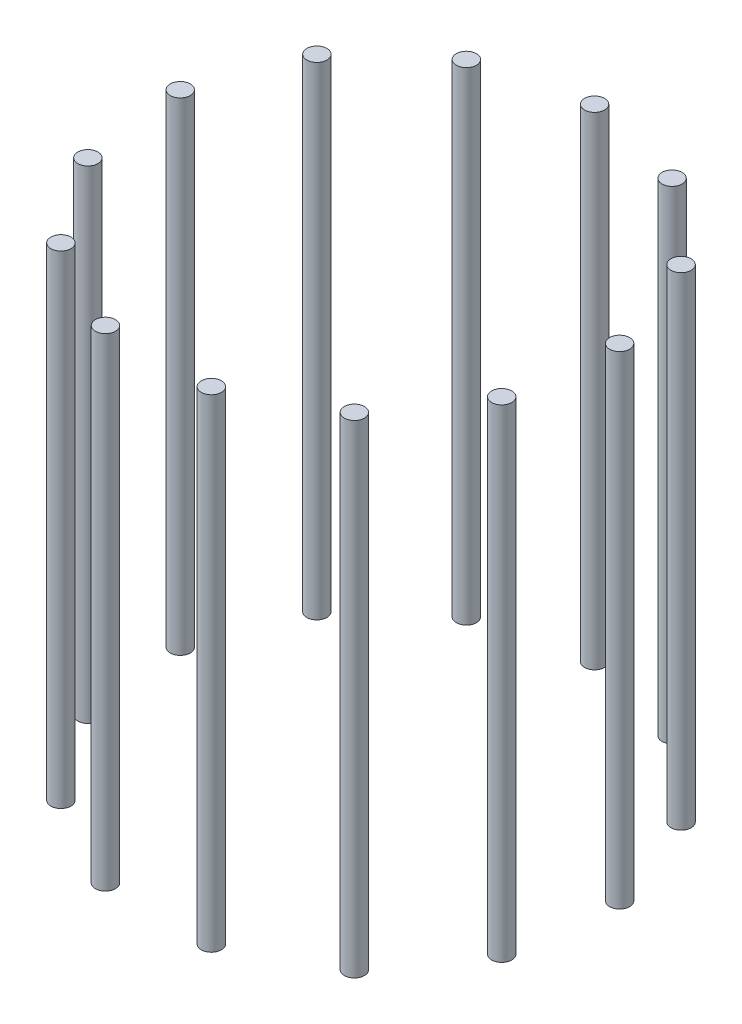
ISO-10303-21;
HEADER;
FILE_DESCRIPTION(('STEP AP214'),'2;1');
FILE_NAME('part.step','',(''),(''),'','','');
FILE_SCHEMA(('AUTOMOTIVE_DESIGN { 1 0 10303 214 1 1 1 1 }'));
ENDSEC;
DATA;
#1=APPLICATION_CONTEXT('core data for automotive mechanical design processes');
#2=APPLICATION_PROTOCOL_DEFINITION('international standard','automotive_design',2000,#1);
#3=PRODUCT_CONTEXT('',#1,'mechanical');
#4=PRODUCT('Part','Part','',(#3));
#5=PRODUCT_RELATED_PRODUCT_CATEGORY('part','',(#4));
#6=PRODUCT_DEFINITION_FORMATION('','',#4);
#7=PRODUCT_DEFINITION_CONTEXT('part definition',#1,'design');
#8=PRODUCT_DEFINITION('design','',#6,#7);
#9=PRODUCT_DEFINITION_SHAPE('','',#8);
#10=(LENGTH_UNIT() NAMED_UNIT(*) SI_UNIT(.MILLI.,.METRE.));
#11=(NAMED_UNIT(*) PLANE_ANGLE_UNIT() SI_UNIT($,.RADIAN.));
#12=(NAMED_UNIT(*) SI_UNIT($,.STERADIAN.) SOLID_ANGLE_UNIT());
#13=UNCERTAINTY_MEASURE_WITH_UNIT(LENGTH_MEASURE(1.E-05),#10,'distance_accuracy_value','');
#14=(GEOMETRIC_REPRESENTATION_CONTEXT(3) GLOBAL_UNCERTAINTY_ASSIGNED_CONTEXT((#13)) GLOBAL_UNIT_ASSIGNED_CONTEXT((#10,
#11,#12)) REPRESENTATION_CONTEXT('',''));
#15=CARTESIAN_POINT('',(0.,0.,0.));
#16=DIRECTION('',(0.,0.,1.));
#17=DIRECTION('',(1.,0.,0.));
#18=AXIS2_PLACEMENT_3D('',#15,#16,#17);
#19=CARTESIAN_POINT('',(-2.5559774462407,-12.,-4.87000814109254));
#20=DIRECTION('',(0.,1.,0.));
#21=DIRECTION('',(0.,0.,1.));
#22=AXIS2_PLACEMENT_3D('',#19,#20,#21);
#23=CYLINDRICAL_SURFACE('',#22,0.250000000000128);
#24=CARTESIAN_POINT('',(-2.5559774462407,-12.,-4.87000814109254));
#25=DIRECTION('',(0.,1.,0.));
#26=DIRECTION('',(0.,0.,1.));
#27=AXIS2_PLACEMENT_3D('',#24,#25,#26);
#28=CIRCLE('',#27,0.250000000000128);
#29=CARTESIAN_POINT('',(-2.5559774462407,-12.,-4.62000814109242));
#30=VERTEX_POINT('',#29);
#31=EDGE_CURVE('E11',#30,#30,#28,.T.);
#32=ORIENTED_EDGE('',*,*,#31,.T.);
#33=EDGE_LOOP('',(#32));
#34=FACE_BOUND('',#33,.T.);
#35=CARTESIAN_POINT('',(-2.5559774462407,0.,-4.87000814109254));
#36=DIRECTION('',(0.,1.,0.));
#37=DIRECTION('',(0.,0.,1.));
#38=AXIS2_PLACEMENT_3D('',#35,#36,#37);
#39=CIRCLE('',#38,0.250000000000128);
#40=CARTESIAN_POINT('',(-2.5559774462407,0.,-4.62000814109242));
#41=VERTEX_POINT('',#40);
#42=EDGE_CURVE('E45',#41,#41,#39,.T.);
#43=ORIENTED_EDGE('',*,*,#42,.F.);
#44=EDGE_LOOP('',(#43));
#45=FACE_BOUND('',#44,.T.);
#46=ADVANCED_FACE('F42',(#34,#45),#23,.T.);
#47=CARTESIAN_POINT('',(-2.5559774462407,-12.,-4.87000814109254));
#48=DIRECTION('',(0.,1.,0.));
#49=DIRECTION('',(0.,0.,1.));
#50=AXIS2_PLACEMENT_3D('',#47,#48,#49);
#51=PLANE('',#50);
#52=ORIENTED_EDGE('',*,*,#31,.F.);
#53=EDGE_LOOP('',(#52));
#54=FACE_BOUND('',#53,.T.);
#55=ADVANCED_FACE('F57',(#54),#51,.F.);
#56=CARTESIAN_POINT('',(-2.5559774462407,0.,-4.87000814109254));
#57=DIRECTION('',(0.,1.,0.));
#58=DIRECTION('',(0.,0.,1.));
#59=AXIS2_PLACEMENT_3D('',#56,#57,#58);
#60=PLANE('',#59);
#61=ORIENTED_EDGE('',*,*,#42,.T.);
#62=EDGE_LOOP('',(#61));
#63=FACE_BOUND('',#62,.T.);
#64=ADVANCED_FACE('F54',(#63),#60,.T.);
#65=CLOSED_SHELL('',(#46,#55,#64));
#66=MANIFOLD_SOLID_BREP('B2',#65);
#67=CARTESIAN_POINT('',(-4.52641126241501,-12.,-3.12435610702116));
#68=DIRECTION('',(0.,1.,0.));
#69=DIRECTION('',(0.,0.,1.));
#70=AXIS2_PLACEMENT_3D('',#67,#68,#69);
#71=CYLINDRICAL_SURFACE('',#70,0.250000000000218);
#72=CARTESIAN_POINT('',(-4.52641126241501,-12.,-3.12435610702116));
#73=DIRECTION('',(0.,1.,0.));
#74=DIRECTION('',(0.,0.,1.));
#75=AXIS2_PLACEMENT_3D('',#72,#73,#74);
#76=CIRCLE('',#75,0.250000000000218);
#77=CARTESIAN_POINT('',(-4.52641126241501,-12.,-2.87435610702095));
#78=VERTEX_POINT('',#77);
#79=EDGE_CURVE('E41',#78,#78,#76,.T.);
#80=ORIENTED_EDGE('',*,*,#79,.T.);
#81=EDGE_LOOP('',(#80));
#82=FACE_BOUND('',#81,.T.);
#83=CARTESIAN_POINT('',(-4.52641126241501,0.,-3.12435610702116));
#84=DIRECTION('',(0.,1.,0.));
#85=DIRECTION('',(0.,0.,1.));
#86=AXIS2_PLACEMENT_3D('',#83,#84,#85);
#87=CIRCLE('',#86,0.250000000000218);
#88=CARTESIAN_POINT('',(-4.52641126241501,0.,-2.87435610702095));
#89=VERTEX_POINT('',#88);
#90=EDGE_CURVE('E94',#89,#89,#87,.T.);
#91=ORIENTED_EDGE('',*,*,#90,.F.);
#92=EDGE_LOOP('',(#91));
#93=FACE_BOUND('',#92,.T.);
#94=ADVANCED_FACE('F91',(#82,#93),#71,.T.);
#95=CARTESIAN_POINT('',(-4.52641126241501,-12.,-3.12435610702116));
#96=DIRECTION('',(0.,1.,0.));
#97=DIRECTION('',(0.,0.,1.));
#98=AXIS2_PLACEMENT_3D('',#95,#96,#97);
#99=PLANE('',#98);
#100=ORIENTED_EDGE('',*,*,#79,.F.);
#101=EDGE_LOOP('',(#100));
#102=FACE_BOUND('',#101,.T.);
#103=ADVANCED_FACE('F106',(#102),#99,.F.);
#104=CARTESIAN_POINT('',(-4.52641126241501,0.,-3.12435610702116));
#105=DIRECTION('',(0.,1.,0.));
#106=DIRECTION('',(0.,0.,1.));
#107=AXIS2_PLACEMENT_3D('',#104,#105,#106);
#108=PLANE('',#107);
#109=ORIENTED_EDGE('',*,*,#90,.T.);
#110=EDGE_LOOP('',(#109));
#111=FACE_BOUND('',#110,.T.);
#112=ADVANCED_FACE('F103',(#111),#108,.T.);
#113=CLOSED_SHELL('',(#94,#103,#112));
#114=MANIFOLD_SOLID_BREP('B6',#113);
#115=CARTESIAN_POINT('',(-5.45989880753909,-12.,-0.662951741404041));
#116=DIRECTION('',(0.,1.,0.));
#117=DIRECTION('',(0.,0.,1.));
#118=AXIS2_PLACEMENT_3D('',#115,#116,#117);
#119=CYLINDRICAL_SURFACE('',#118,0.250000000000326);
#120=CARTESIAN_POINT('',(-5.45989880753909,-12.,-0.662951741404041));
#121=DIRECTION('',(0.,1.,0.));
#122=DIRECTION('',(0.,0.,1.));
#123=AXIS2_PLACEMENT_3D('',#120,#121,#122);
#124=CIRCLE('',#123,0.250000000000326);
#125=CARTESIAN_POINT('',(-5.45989880753909,-12.,-0.412951741403715));
#126=VERTEX_POINT('',#125);
#127=EDGE_CURVE('E90',#126,#126,#124,.T.);
#128=ORIENTED_EDGE('',*,*,#127,.T.);
#129=EDGE_LOOP('',(#128));
#130=FACE_BOUND('',#129,.T.);
#131=CARTESIAN_POINT('',(-5.45989880753909,0.,-0.662951741404041));
#132=DIRECTION('',(0.,1.,0.));
#133=DIRECTION('',(0.,0.,1.));
#134=AXIS2_PLACEMENT_3D('',#131,#132,#133);
#135=CIRCLE('',#134,0.250000000000326);
#136=CARTESIAN_POINT('',(-5.45989880753909,0.,-0.412951741403715));
#137=VERTEX_POINT('',#136);
#138=EDGE_CURVE('E143',#137,#137,#135,.T.);
#139=ORIENTED_EDGE('',*,*,#138,.F.);
#140=EDGE_LOOP('',(#139));
#141=FACE_BOUND('',#140,.T.);
#142=ADVANCED_FACE('F140',(#130,#141),#119,.T.);
#143=CARTESIAN_POINT('',(-5.45989880753909,-12.,-0.662951741404041));
#144=DIRECTION('',(0.,1.,0.));
#145=DIRECTION('',(0.,0.,1.));
#146=AXIS2_PLACEMENT_3D('',#143,#144,#145);
#147=PLANE('',#146);
#148=ORIENTED_EDGE('',*,*,#127,.F.);
#149=EDGE_LOOP('',(#148));
#150=FACE_BOUND('',#149,.T.);
#151=ADVANCED_FACE('F155',(#150),#147,.F.);
#152=CARTESIAN_POINT('',(-5.45989880753909,0.,-0.662951741404041));
#153=DIRECTION('',(0.,1.,0.));
#154=DIRECTION('',(0.,0.,1.));
#155=AXIS2_PLACEMENT_3D('',#152,#153,#154);
#156=PLANE('',#155);
#157=ORIENTED_EDGE('',*,*,#138,.T.);
#158=EDGE_LOOP('',(#157));
#159=FACE_BOUND('',#158,.T.);
#160=ADVANCED_FACE('F152',(#159),#156,.T.);
#161=CLOSED_SHELL('',(#142,#151,#160));
#162=MANIFOLD_SOLID_BREP('B36',#161);
#163=CARTESIAN_POINT('',(-5.14258933476946,-12.,1.95032687873417));
#164=DIRECTION('',(0.,1.,0.));
#165=DIRECTION('',(0.,0.,1.));
#166=AXIS2_PLACEMENT_3D('',#163,#164,#165);
#167=CYLINDRICAL_SURFACE('',#166,0.250000000000417);
#168=CARTESIAN_POINT('',(-5.14258933476946,-12.,1.95032687873417));
#169=DIRECTION('',(0.,1.,0.));
#170=DIRECTION('',(0.,0.,1.));
#171=AXIS2_PLACEMENT_3D('',#168,#169,#170);
#172=CIRCLE('',#171,0.250000000000417);
#173=CARTESIAN_POINT('',(-5.14258933476946,-12.,2.20032687873458));
#174=VERTEX_POINT('',#173);
#175=EDGE_CURVE('E139',#174,#174,#172,.T.);
#176=ORIENTED_EDGE('',*,*,#175,.T.);
#177=EDGE_LOOP('',(#176));
#178=FACE_BOUND('',#177,.T.);
#179=CARTESIAN_POINT('',(-5.14258933476946,0.,1.95032687873417));
#180=DIRECTION('',(0.,1.,0.));
#181=DIRECTION('',(0.,0.,1.));
#182=AXIS2_PLACEMENT_3D('',#179,#180,#181);
#183=CIRCLE('',#182,0.250000000000417);
#184=CARTESIAN_POINT('',(-5.14258933476946,0.,2.20032687873458));
#185=VERTEX_POINT('',#184);
#186=EDGE_CURVE('E192',#185,#185,#183,.T.);
#187=ORIENTED_EDGE('',*,*,#186,.F.);
#188=EDGE_LOOP('',(#187));
#189=FACE_BOUND('',#188,.T.);
#190=ADVANCED_FACE('F189',(#178,#189),#167,.T.);
#191=CARTESIAN_POINT('',(-5.14258933476946,-12.,1.95032687873417));
#192=DIRECTION('',(0.,1.,0.));
#193=DIRECTION('',(0.,0.,1.));
#194=AXIS2_PLACEMENT_3D('',#191,#192,#193);
#195=PLANE('',#194);
#196=ORIENTED_EDGE('',*,*,#175,.F.);
#197=EDGE_LOOP('',(#196));
#198=FACE_BOUND('',#197,.T.);
#199=ADVANCED_FACE('F204',(#198),#195,.F.);
#200=CARTESIAN_POINT('',(-5.14258933476946,0.,1.95032687873417));
#201=DIRECTION('',(0.,1.,0.));
#202=DIRECTION('',(0.,0.,1.));
#203=AXIS2_PLACEMENT_3D('',#200,#201,#202);
#204=PLANE('',#203);
#205=ORIENTED_EDGE('',*,*,#186,.T.);
#206=EDGE_LOOP('',(#205));
#207=FACE_BOUND('',#206,.T.);
#208=ADVANCED_FACE('F201',(#207),#204,.T.);
#209=CLOSED_SHELL('',(#190,#199,#208));
#210=MANIFOLD_SOLID_BREP('B85',#209);
#211=CARTESIAN_POINT('',(-3.64717462032396,-12.,4.11680911494121));
#212=DIRECTION('',(0.,1.,0.));
#213=DIRECTION('',(0.,0.,1.));
#214=AXIS2_PLACEMENT_3D('',#211,#212,#213);
#215=CYLINDRICAL_SURFACE('',#214,0.250000000000482);
#216=CARTESIAN_POINT('',(-3.64717462032396,-12.,4.11680911494121));
#217=DIRECTION('',(0.,1.,0.));
#218=DIRECTION('',(0.,0.,1.));
#219=AXIS2_PLACEMENT_3D('',#216,#217,#218);
#220=CIRCLE('',#219,0.250000000000482);
#221=CARTESIAN_POINT('',(-3.64717462032396,-12.,4.36680911494169));
#222=VERTEX_POINT('',#221);
#223=EDGE_CURVE('E188',#222,#222,#220,.T.);
#224=ORIENTED_EDGE('',*,*,#223,.T.);
#225=EDGE_LOOP('',(#224));
#226=FACE_BOUND('',#225,.T.);
#227=CARTESIAN_POINT('',(-3.64717462032396,0.,4.11680911494121));
#228=DIRECTION('',(0.,1.,0.));
#229=DIRECTION('',(0.,0.,1.));
#230=AXIS2_PLACEMENT_3D('',#227,#228,#229);
#231=CIRCLE('',#230,0.250000000000482);
#232=CARTESIAN_POINT('',(-3.64717462032396,0.,4.36680911494169));
#233=VERTEX_POINT('',#232);
#234=EDGE_CURVE('E241',#233,#233,#231,.T.);
#235=ORIENTED_EDGE('',*,*,#234,.F.);
#236=EDGE_LOOP('',(#235));
#237=FACE_BOUND('',#236,.T.);
#238=ADVANCED_FACE('F238',(#226,#237),#215,.T.);
#239=CARTESIAN_POINT('',(-3.64717462032396,-12.,4.11680911494121));
#240=DIRECTION('',(0.,1.,0.));
#241=DIRECTION('',(0.,0.,1.));
#242=AXIS2_PLACEMENT_3D('',#239,#240,#241);
#243=PLANE('',#242);
#244=ORIENTED_EDGE('',*,*,#223,.F.);
#245=EDGE_LOOP('',(#244));
#246=FACE_BOUND('',#245,.T.);
#247=ADVANCED_FACE('F253',(#246),#243,.F.);
#248=CARTESIAN_POINT('',(-3.64717462032396,0.,4.11680911494121));
#249=DIRECTION('',(0.,1.,0.));
#250=DIRECTION('',(0.,0.,1.));
#251=AXIS2_PLACEMENT_3D('',#248,#249,#250);
#252=PLANE('',#251);
#253=ORIENTED_EDGE('',*,*,#234,.T.);
#254=EDGE_LOOP('',(#253));
#255=FACE_BOUND('',#254,.T.);
#256=ADVANCED_FACE('F250',(#255),#252,.T.);
#257=CLOSED_SHELL('',(#238,#247,#256));
#258=MANIFOLD_SOLID_BREP('B134',#257);
#259=CARTESIAN_POINT('',(-1.31623615358111,-12.,5.34017999584334));
#260=DIRECTION('',(0.,1.,0.));
#261=DIRECTION('',(0.,0.,1.));
#262=AXIS2_PLACEMENT_3D('',#259,#260,#261);
#263=CYLINDRICAL_SURFACE('',#262,0.250000000000497);
#264=CARTESIAN_POINT('',(-1.31623615358111,-12.,5.34017999584334));
#265=DIRECTION('',(0.,1.,0.));
#266=DIRECTION('',(0.,0.,1.));
#267=AXIS2_PLACEMENT_3D('',#264,#265,#266);
#268=CIRCLE('',#267,0.250000000000497);
#269=CARTESIAN_POINT('',(-1.31623615358111,-12.,5.59017999584384));
#270=VERTEX_POINT('',#269);
#271=EDGE_CURVE('E237',#270,#270,#268,.T.);
#272=ORIENTED_EDGE('',*,*,#271,.T.);
#273=EDGE_LOOP('',(#272));
#274=FACE_BOUND('',#273,.T.);
#275=CARTESIAN_POINT('',(-1.31623615358111,0.,5.34017999584334));
#276=DIRECTION('',(0.,1.,0.));
#277=DIRECTION('',(0.,0.,1.));
#278=AXIS2_PLACEMENT_3D('',#275,#276,#277);
#279=CIRCLE('',#278,0.250000000000497);
#280=CARTESIAN_POINT('',(-1.31623615358111,0.,5.59017999584384));
#281=VERTEX_POINT('',#280);
#282=EDGE_CURVE('E290',#281,#281,#279,.T.);
#283=ORIENTED_EDGE('',*,*,#282,.F.);
#284=EDGE_LOOP('',(#283));
#285=FACE_BOUND('',#284,.T.);
#286=ADVANCED_FACE('F287',(#274,#285),#263,.T.);
#287=CARTESIAN_POINT('',(-1.31623615358111,-12.,5.34017999584334));
#288=DIRECTION('',(0.,1.,0.));
#289=DIRECTION('',(0.,0.,1.));
#290=AXIS2_PLACEMENT_3D('',#287,#288,#289);
#291=PLANE('',#290);
#292=ORIENTED_EDGE('',*,*,#271,.F.);
#293=EDGE_LOOP('',(#292));
#294=FACE_BOUND('',#293,.T.);
#295=ADVANCED_FACE('F302',(#294),#291,.F.);
#296=CARTESIAN_POINT('',(-1.31623615358111,0.,5.34017999584334));
#297=DIRECTION('',(0.,1.,0.));
#298=DIRECTION('',(0.,0.,1.));
#299=AXIS2_PLACEMENT_3D('',#296,#297,#298);
#300=PLANE('',#299);
#301=ORIENTED_EDGE('',*,*,#282,.T.);
#302=EDGE_LOOP('',(#301));
#303=FACE_BOUND('',#302,.T.);
#304=ADVANCED_FACE('F299',(#303),#300,.T.);
#305=CLOSED_SHELL('',(#286,#295,#304));
#306=MANIFOLD_SOLID_BREP('B183',#305);
#307=CARTESIAN_POINT('',(1.31623615358203,-12.,5.34017999584323));
#308=DIRECTION('',(0.,1.,0.));
#309=DIRECTION('',(0.,0.,1.));
#310=AXIS2_PLACEMENT_3D('',#307,#308,#309);
#311=CYLINDRICAL_SURFACE('',#310,0.250000000000458);
#312=CARTESIAN_POINT('',(1.31623615358203,-12.,5.34017999584323));
#313=DIRECTION('',(0.,1.,0.));
#314=DIRECTION('',(0.,0.,1.));
#315=AXIS2_PLACEMENT_3D('',#312,#313,#314);
#316=CIRCLE('',#315,0.250000000000458);
#317=CARTESIAN_POINT('',(1.31623615358203,-12.,5.59017999584369));
#318=VERTEX_POINT('',#317);
#319=EDGE_CURVE('E286',#318,#318,#316,.T.);
#320=ORIENTED_EDGE('',*,*,#319,.T.);
#321=EDGE_LOOP('',(#320));
#322=FACE_BOUND('',#321,.T.);
#323=CARTESIAN_POINT('',(1.31623615358203,0.,5.34017999584323));
#324=DIRECTION('',(0.,1.,0.));
#325=DIRECTION('',(0.,0.,1.));
#326=AXIS2_PLACEMENT_3D('',#323,#324,#325);
#327=CIRCLE('',#326,0.250000000000458);
#328=CARTESIAN_POINT('',(1.31623615358203,0.,5.59017999584369));
#329=VERTEX_POINT('',#328);
#330=EDGE_CURVE('E339',#329,#329,#327,.T.);
#331=ORIENTED_EDGE('',*,*,#330,.F.);
#332=EDGE_LOOP('',(#331));
#333=FACE_BOUND('',#332,.T.);
#334=ADVANCED_FACE('F336',(#322,#333),#311,.T.);
#335=CARTESIAN_POINT('',(1.31623615358203,-12.,5.34017999584323));
#336=DIRECTION('',(0.,1.,0.));
#337=DIRECTION('',(0.,0.,1.));
#338=AXIS2_PLACEMENT_3D('',#335,#336,#337);
#339=PLANE('',#338);
#340=ORIENTED_EDGE('',*,*,#319,.F.);
#341=EDGE_LOOP('',(#340));
#342=FACE_BOUND('',#341,.T.);
#343=ADVANCED_FACE('F351',(#342),#339,.F.);
#344=CARTESIAN_POINT('',(1.31623615358203,0.,5.34017999584323));
#345=DIRECTION('',(0.,1.,0.));
#346=DIRECTION('',(0.,0.,1.));
#347=AXIS2_PLACEMENT_3D('',#344,#345,#346);
#348=PLANE('',#347);
#349=ORIENTED_EDGE('',*,*,#330,.T.);
#350=EDGE_LOOP('',(#349));
#351=FACE_BOUND('',#350,.T.);
#352=ADVANCED_FACE('F348',(#351),#348,.T.);
#353=CLOSED_SHELL('',(#334,#343,#352));
#354=MANIFOLD_SOLID_BREP('B232',#353);
#355=CARTESIAN_POINT('',(3.64717462032478,-12.,4.1168091149409));
#356=DIRECTION('',(0.,1.,0.));
#357=DIRECTION('',(0.,0.,1.));
#358=AXIS2_PLACEMENT_3D('',#355,#356,#357);
#359=CYLINDRICAL_SURFACE('',#358,0.250000000000372);
#360=CARTESIAN_POINT('',(3.64717462032478,-12.,4.1168091149409));
#361=DIRECTION('',(0.,1.,0.));
#362=DIRECTION('',(0.,0.,1.));
#363=AXIS2_PLACEMENT_3D('',#360,#361,#362);
#364=CIRCLE('',#363,0.250000000000372);
#365=CARTESIAN_POINT('',(3.64717462032478,-12.,4.36680911494127));
#366=VERTEX_POINT('',#365);
#367=EDGE_CURVE('E335',#366,#366,#364,.T.);
#368=ORIENTED_EDGE('',*,*,#367,.T.);
#369=EDGE_LOOP('',(#368));
#370=FACE_BOUND('',#369,.T.);
#371=CARTESIAN_POINT('',(3.64717462032478,0.,4.1168091149409));
#372=DIRECTION('',(0.,1.,0.));
#373=DIRECTION('',(0.,0.,1.));
#374=AXIS2_PLACEMENT_3D('',#371,#372,#373);
#375=CIRCLE('',#374,0.250000000000372);
#376=CARTESIAN_POINT('',(3.64717462032478,0.,4.36680911494127));
#377=VERTEX_POINT('',#376);
#378=EDGE_CURVE('E388',#377,#377,#375,.T.);
#379=ORIENTED_EDGE('',*,*,#378,.F.);
#380=EDGE_LOOP('',(#379));
#381=FACE_BOUND('',#380,.T.);
#382=ADVANCED_FACE('F385',(#370,#381),#359,.T.);
#383=CARTESIAN_POINT('',(3.64717462032478,-12.,4.1168091149409));
#384=DIRECTION('',(0.,1.,0.));
#385=DIRECTION('',(0.,0.,1.));
#386=AXIS2_PLACEMENT_3D('',#383,#384,#385);
#387=PLANE('',#386);
#388=ORIENTED_EDGE('',*,*,#367,.F.);
#389=EDGE_LOOP('',(#388));
#390=FACE_BOUND('',#389,.T.);
#391=ADVANCED_FACE('F400',(#390),#387,.F.);
#392=CARTESIAN_POINT('',(3.64717462032478,0.,4.1168091149409));
#393=DIRECTION('',(0.,1.,0.));
#394=DIRECTION('',(0.,0.,1.));
#395=AXIS2_PLACEMENT_3D('',#392,#393,#394);
#396=PLANE('',#395);
#397=ORIENTED_EDGE('',*,*,#378,.T.);
#398=EDGE_LOOP('',(#397));
#399=FACE_BOUND('',#398,.T.);
#400=ADVANCED_FACE('F397',(#399),#396,.T.);
#401=CLOSED_SHELL('',(#382,#391,#400));
#402=MANIFOLD_SOLID_BREP('B281',#401);
#403=CARTESIAN_POINT('',(5.1425893347701,-12.,1.95032687873373));
#404=DIRECTION('',(0.,1.,0.));
#405=DIRECTION('',(0.,0.,1.));
#406=AXIS2_PLACEMENT_3D('',#403,#404,#405);
#407=CYLINDRICAL_SURFACE('',#406,0.250000000000262);
#408=CARTESIAN_POINT('',(5.1425893347701,-12.,1.95032687873373));
#409=DIRECTION('',(0.,1.,0.));
#410=DIRECTION('',(0.,0.,1.));
#411=AXIS2_PLACEMENT_3D('',#408,#409,#410);
#412=CIRCLE('',#411,0.250000000000262);
#413=CARTESIAN_POINT('',(5.1425893347701,-12.,2.20032687873399));
#414=VERTEX_POINT('',#413);
#415=EDGE_CURVE('E384',#414,#414,#412,.T.);
#416=ORIENTED_EDGE('',*,*,#415,.T.);
#417=EDGE_LOOP('',(#416));
#418=FACE_BOUND('',#417,.T.);
#419=CARTESIAN_POINT('',(5.1425893347701,0.,1.95032687873373));
#420=DIRECTION('',(0.,1.,0.));
#421=DIRECTION('',(0.,0.,1.));
#422=AXIS2_PLACEMENT_3D('',#419,#420,#421);
#423=CIRCLE('',#422,0.250000000000262);
#424=CARTESIAN_POINT('',(5.1425893347701,0.,2.20032687873399));
#425=VERTEX_POINT('',#424);
#426=EDGE_CURVE('E437',#425,#425,#423,.T.);
#427=ORIENTED_EDGE('',*,*,#426,.F.);
#428=EDGE_LOOP('',(#427));
#429=FACE_BOUND('',#428,.T.);
#430=ADVANCED_FACE('F434',(#418,#429),#407,.T.);
#431=CARTESIAN_POINT('',(5.1425893347701,-12.,1.95032687873373));
#432=DIRECTION('',(0.,1.,0.));
#433=DIRECTION('',(0.,0.,1.));
#434=AXIS2_PLACEMENT_3D('',#431,#432,#433);
#435=PLANE('',#434);
#436=ORIENTED_EDGE('',*,*,#415,.F.);
#437=EDGE_LOOP('',(#436));
#438=FACE_BOUND('',#437,.T.);
#439=ADVANCED_FACE('F449',(#438),#435,.F.);
#440=CARTESIAN_POINT('',(5.1425893347701,0.,1.95032687873373));
#441=DIRECTION('',(0.,1.,0.));
#442=DIRECTION('',(0.,0.,1.));
#443=AXIS2_PLACEMENT_3D('',#440,#441,#442);
#444=PLANE('',#443);
#445=ORIENTED_EDGE('',*,*,#426,.T.);
#446=EDGE_LOOP('',(#445));
#447=FACE_BOUND('',#446,.T.);
#448=ADVANCED_FACE('F446',(#447),#444,.T.);
#449=CLOSED_SHELL('',(#430,#439,#448));
#450=MANIFOLD_SOLID_BREP('B330',#449);
#451=CARTESIAN_POINT('',(5.4598988075395,-12.,-0.66295174140451));
#452=DIRECTION('',(0.,1.,0.));
#453=DIRECTION('',(0.,0.,1.));
#454=AXIS2_PLACEMENT_3D('',#451,#452,#453);
#455=CYLINDRICAL_SURFACE('',#454,0.250000000000146);
#456=CARTESIAN_POINT('',(5.4598988075395,-12.,-0.66295174140451));
#457=DIRECTION('',(0.,1.,0.));
#458=DIRECTION('',(0.,0.,1.));
#459=AXIS2_PLACEMENT_3D('',#456,#457,#458);
#460=CIRCLE('',#459,0.250000000000146);
#461=CARTESIAN_POINT('',(5.4598988075395,-12.,-0.412951741404363));
#462=VERTEX_POINT('',#461);
#463=EDGE_CURVE('E433',#462,#462,#460,.T.);
#464=ORIENTED_EDGE('',*,*,#463,.T.);
#465=EDGE_LOOP('',(#464));
#466=FACE_BOUND('',#465,.T.);
#467=CARTESIAN_POINT('',(5.4598988075395,0.,-0.66295174140451));
#468=DIRECTION('',(0.,1.,0.));
#469=DIRECTION('',(0.,0.,1.));
#470=AXIS2_PLACEMENT_3D('',#467,#468,#469);
#471=CIRCLE('',#470,0.250000000000146);
#472=CARTESIAN_POINT('',(5.4598988075395,0.,-0.412951741404363));
#473=VERTEX_POINT('',#472);
#474=EDGE_CURVE('E486',#473,#473,#471,.T.);
#475=ORIENTED_EDGE('',*,*,#474,.F.);
#476=EDGE_LOOP('',(#475));
#477=FACE_BOUND('',#476,.T.);
#478=ADVANCED_FACE('F483',(#466,#477),#455,.T.);
#479=CARTESIAN_POINT('',(5.4598988075395,-12.,-0.66295174140451));
#480=DIRECTION('',(0.,1.,0.));
#481=DIRECTION('',(0.,0.,1.));
#482=AXIS2_PLACEMENT_3D('',#479,#480,#481);
#483=PLANE('',#482);
#484=ORIENTED_EDGE('',*,*,#463,.F.);
#485=EDGE_LOOP('',(#484));
#486=FACE_BOUND('',#485,.T.);
#487=ADVANCED_FACE('F498',(#486),#483,.F.);
#488=CARTESIAN_POINT('',(5.4598988075395,0.,-0.66295174140451));
#489=DIRECTION('',(0.,1.,0.));
#490=DIRECTION('',(0.,0.,1.));
#491=AXIS2_PLACEMENT_3D('',#488,#489,#490);
#492=PLANE('',#491);
#493=ORIENTED_EDGE('',*,*,#474,.T.);
#494=EDGE_LOOP('',(#493));
#495=FACE_BOUND('',#494,.T.);
#496=ADVANCED_FACE('F495',(#495),#492,.T.);
#497=CLOSED_SHELL('',(#478,#487,#496));
#498=MANIFOLD_SOLID_BREP('B379',#497);
#499=CARTESIAN_POINT('',(4.52641126241521,-12.,-3.12435610702155));
#500=DIRECTION('',(0.,1.,0.));
#501=DIRECTION('',(0.,0.,1.));
#502=AXIS2_PLACEMENT_3D('',#499,#500,#501);
#503=CYLINDRICAL_SURFACE('',#502,0.250000000000052);
#504=CARTESIAN_POINT('',(4.52641126241521,-12.,-3.12435610702155));
#505=DIRECTION('',(0.,1.,0.));
#506=DIRECTION('',(0.,0.,1.));
#507=AXIS2_PLACEMENT_3D('',#504,#505,#506);
#508=CIRCLE('',#507,0.250000000000052);
#509=CARTESIAN_POINT('',(4.52641126241521,-12.,-2.8743561070215));
#510=VERTEX_POINT('',#509);
#511=EDGE_CURVE('E482',#510,#510,#508,.T.);
#512=ORIENTED_EDGE('',*,*,#511,.T.);
#513=EDGE_LOOP('',(#512));
#514=FACE_BOUND('',#513,.T.);
#515=CARTESIAN_POINT('',(4.52641126241521,0.,-3.12435610702155));
#516=DIRECTION('',(0.,1.,0.));
#517=DIRECTION('',(0.,0.,1.));
#518=AXIS2_PLACEMENT_3D('',#515,#516,#517);
#519=CIRCLE('',#518,0.250000000000052);
#520=CARTESIAN_POINT('',(4.52641126241521,0.,-2.8743561070215));
#521=VERTEX_POINT('',#520);
#522=EDGE_CURVE('E535',#521,#521,#519,.T.);
#523=ORIENTED_EDGE('',*,*,#522,.F.);
#524=EDGE_LOOP('',(#523));
#525=FACE_BOUND('',#524,.T.);
#526=ADVANCED_FACE('F532',(#514,#525),#503,.T.);
#527=CARTESIAN_POINT('',(4.52641126241521,-12.,-3.12435610702155));
#528=DIRECTION('',(0.,1.,0.));
#529=DIRECTION('',(0.,0.,1.));
#530=AXIS2_PLACEMENT_3D('',#527,#528,#529);
#531=PLANE('',#530);
#532=ORIENTED_EDGE('',*,*,#511,.F.);
#533=EDGE_LOOP('',(#532));
#534=FACE_BOUND('',#533,.T.);
#535=ADVANCED_FACE('F547',(#534),#531,.F.);
#536=CARTESIAN_POINT('',(4.52641126241521,0.,-3.12435610702155));
#537=DIRECTION('',(0.,1.,0.));
#538=DIRECTION('',(0.,0.,1.));
#539=AXIS2_PLACEMENT_3D('',#536,#537,#538);
#540=PLANE('',#539);
#541=ORIENTED_EDGE('',*,*,#522,.T.);
#542=EDGE_LOOP('',(#541));
#543=FACE_BOUND('',#542,.T.);
#544=ADVANCED_FACE('F544',(#543),#540,.T.);
#545=CLOSED_SHELL('',(#526,#535,#544));
#546=MANIFOLD_SOLID_BREP('B428',#545);
#547=CARTESIAN_POINT('',(2.55597744624073,-12.,-4.87000814109265));
#548=DIRECTION('',(0.,1.,0.));
#549=DIRECTION('',(0.,0.,1.));
#550=AXIS2_PLACEMENT_3D('',#547,#548,#549);
#551=CYLINDRICAL_SURFACE('',#550,0.25);
#552=CARTESIAN_POINT('',(2.55597744624073,-12.,-4.87000814109265));
#553=DIRECTION('',(0.,1.,0.));
#554=DIRECTION('',(0.,0.,1.));
#555=AXIS2_PLACEMENT_3D('',#552,#553,#554);
#556=CIRCLE('',#555,0.25);
#557=CARTESIAN_POINT('',(2.55597744624073,-12.,-4.62000814109265));
#558=VERTEX_POINT('',#557);
#559=EDGE_CURVE('E531',#558,#558,#556,.T.);
#560=ORIENTED_EDGE('',*,*,#559,.T.);
#561=EDGE_LOOP('',(#560));
#562=FACE_BOUND('',#561,.T.);
#563=CARTESIAN_POINT('',(2.55597744624073,0.,-4.87000814109265));
#564=DIRECTION('',(0.,1.,0.));
#565=DIRECTION('',(0.,0.,1.));
#566=AXIS2_PLACEMENT_3D('',#563,#564,#565);
#567=CIRCLE('',#566,0.25);
#568=CARTESIAN_POINT('',(2.55597744624073,0.,-4.62000814109265));
#569=VERTEX_POINT('',#568);
#570=EDGE_CURVE('E583',#569,#569,#567,.T.);
#571=ORIENTED_EDGE('',*,*,#570,.F.);
#572=EDGE_LOOP('',(#571));
#573=FACE_BOUND('',#572,.T.);
#574=ADVANCED_FACE('F580',(#562,#573),#551,.T.);
#575=CARTESIAN_POINT('',(2.55597744624073,-12.,-4.87000814109265));
#576=DIRECTION('',(0.,1.,0.));
#577=DIRECTION('',(0.,0.,1.));
#578=AXIS2_PLACEMENT_3D('',#575,#576,#577);
#579=PLANE('',#578);
#580=ORIENTED_EDGE('',*,*,#559,.F.);
#581=EDGE_LOOP('',(#580));
#582=FACE_BOUND('',#581,.T.);
#583=ADVANCED_FACE('F595',(#582),#579,.F.);
#584=CARTESIAN_POINT('',(2.55597744624073,0.,-4.87000814109265));
#585=DIRECTION('',(0.,1.,0.));
#586=DIRECTION('',(0.,0.,1.));
#587=AXIS2_PLACEMENT_3D('',#584,#585,#586);
#588=PLANE('',#587);
#589=ORIENTED_EDGE('',*,*,#570,.T.);
#590=EDGE_LOOP('',(#589));
#591=FACE_BOUND('',#590,.T.);
#592=ADVANCED_FACE('F592',(#591),#588,.T.);
#593=CLOSED_SHELL('',(#574,#583,#592));
#594=MANIFOLD_SOLID_BREP('B477',#593);
#595=CARTESIAN_POINT('',(0.,-12.,-5.5));
#596=DIRECTION('',(0.,1.,0.));
#597=DIRECTION('',(0.,0.,1.));
#598=AXIS2_PLACEMENT_3D('',#595,#596,#597);
#599=CYLINDRICAL_SURFACE('',#598,0.25);
#600=CARTESIAN_POINT('',(0.,-12.,-5.5));
#601=DIRECTION('',(0.,1.,0.));
#602=DIRECTION('',(0.,0.,1.));
#603=AXIS2_PLACEMENT_3D('',#600,#601,#602);
#604=CIRCLE('',#603,0.25);
#605=CARTESIAN_POINT('',(0.,-12.,-5.25));
#606=VERTEX_POINT('',#605);
#607=EDGE_CURVE('E579',#606,#606,#604,.T.);
#608=ORIENTED_EDGE('',*,*,#607,.T.);
#609=EDGE_LOOP('',(#608));
#610=FACE_BOUND('',#609,.T.);
#611=CARTESIAN_POINT('',(0.,0.,-5.5));
#612=DIRECTION('',(0.,1.,0.));
#613=DIRECTION('',(0.,0.,1.));
#614=AXIS2_PLACEMENT_3D('',#611,#612,#613);
#615=CIRCLE('',#614,0.25);
#616=CARTESIAN_POINT('',(0.,0.,-5.25));
#617=VERTEX_POINT('',#616);
#618=EDGE_CURVE('E624',#617,#617,#615,.T.);
#619=ORIENTED_EDGE('',*,*,#618,.F.);
#620=EDGE_LOOP('',(#619));
#621=FACE_BOUND('',#620,.T.);
#622=ADVANCED_FACE('F621',(#610,#621),#599,.T.);
#623=CARTESIAN_POINT('',(0.,-12.,-5.5));
#624=DIRECTION('',(0.,1.,0.));
#625=DIRECTION('',(0.,0.,1.));
#626=AXIS2_PLACEMENT_3D('',#623,#624,#625);
#627=PLANE('',#626);
#628=ORIENTED_EDGE('',*,*,#607,.F.);
#629=EDGE_LOOP('',(#628));
#630=FACE_BOUND('',#629,.T.);
#631=ADVANCED_FACE('F636',(#630),#627,.F.);
#632=CARTESIAN_POINT('',(0.,0.,-5.5));
#633=DIRECTION('',(0.,1.,0.));
#634=DIRECTION('',(0.,0.,1.));
#635=AXIS2_PLACEMENT_3D('',#632,#633,#634);
#636=PLANE('',#635);
#637=ORIENTED_EDGE('',*,*,#618,.T.);
#638=EDGE_LOOP('',(#637));
#639=FACE_BOUND('',#638,.T.);
#640=ADVANCED_FACE('F633',(#639),#636,.T.);
#641=CLOSED_SHELL('',(#622,#631,#640));
#642=MANIFOLD_SOLID_BREP('B526',#641);
#643=ADVANCED_BREP_SHAPE_REPRESENTATION('',(#18,#66,#114,#162,#210,#258,#306,#354,#402,#450,
#498,#546,#594,#642),#14);
#644=SHAPE_DEFINITION_REPRESENTATION(#9,#643);
ENDSEC;
END-ISO-10303-21;
